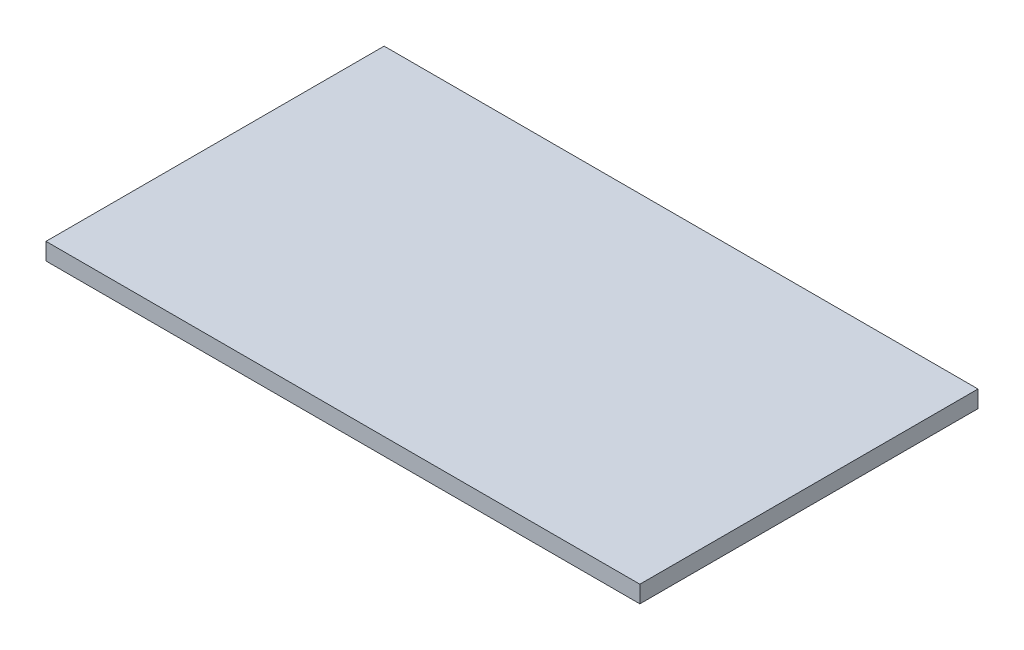
ISO-10303-21;
HEADER;
FILE_DESCRIPTION(('STEP AP214'),'2;1');
FILE_NAME('part.step','',(''),(''),'','','');
FILE_SCHEMA(('AUTOMOTIVE_DESIGN { 1 0 10303 214 1 1 1 1 }'));
ENDSEC;
DATA;
#1=APPLICATION_CONTEXT('core data for automotive mechanical design processes');
#2=APPLICATION_PROTOCOL_DEFINITION('international standard','automotive_design',2000,#1);
#3=PRODUCT_CONTEXT('',#1,'mechanical');
#4=PRODUCT('Part','Part','',(#3));
#5=PRODUCT_RELATED_PRODUCT_CATEGORY('part','',(#4));
#6=PRODUCT_DEFINITION_FORMATION('','',#4);
#7=PRODUCT_DEFINITION_CONTEXT('part definition',#1,'design');
#8=PRODUCT_DEFINITION('design','',#6,#7);
#9=PRODUCT_DEFINITION_SHAPE('','',#8);
#10=(LENGTH_UNIT() NAMED_UNIT(*) SI_UNIT(.MILLI.,.METRE.));
#11=(NAMED_UNIT(*) PLANE_ANGLE_UNIT() SI_UNIT($,.RADIAN.));
#12=(NAMED_UNIT(*) SI_UNIT($,.STERADIAN.) SOLID_ANGLE_UNIT());
#13=UNCERTAINTY_MEASURE_WITH_UNIT(LENGTH_MEASURE(1.E-05),#10,'distance_accuracy_value','');
#14=(GEOMETRIC_REPRESENTATION_CONTEXT(3) GLOBAL_UNCERTAINTY_ASSIGNED_CONTEXT((#13)) GLOBAL_UNIT_ASSIGNED_CONTEXT((#10,
#11,#12)) REPRESENTATION_CONTEXT('',''));
#15=CARTESIAN_POINT('',(0.,0.,0.));
#16=DIRECTION('',(0.,0.,1.));
#17=DIRECTION('',(1.,0.,0.));
#18=AXIS2_PLACEMENT_3D('',#15,#16,#17);
#19=CARTESIAN_POINT('',(-313.5,18.,178.5));
#20=DIRECTION('',(1.,0.,0.));
#21=DIRECTION('',(0.,0.,-1.));
#22=AXIS2_PLACEMENT_3D('',#19,#20,#21);
#23=PLANE('',#22);
#24=DIRECTION('',(0.,0.,1.));
#25=VECTOR('',#24,1.);
#26=CARTESIAN_POINT('',(-313.5,0.,178.5));
#27=LINE('',#26,#25);
#28=CARTESIAN_POINT('',(-313.5,0.,-178.5));
#29=VERTEX_POINT('',#28);
#30=CARTESIAN_POINT('',(-313.5,0.,178.5));
#31=VERTEX_POINT('',#30);
#32=EDGE_CURVE('E96',#29,#31,#27,.T.);
#33=ORIENTED_EDGE('',*,*,#32,.T.);
#34=DIRECTION('',(0.,-1.,0.));
#35=VECTOR('',#34,1.);
#36=CARTESIAN_POINT('',(-313.5,18.,178.5));
#37=LINE('',#36,#35);
#38=CARTESIAN_POINT('',(-313.5,18.,178.5));
#39=VERTEX_POINT('',#38);
#40=EDGE_CURVE('E11',#39,#31,#37,.T.);
#41=ORIENTED_EDGE('',*,*,#40,.F.);
#42=DIRECTION('',(0.,0.,1.));
#43=VECTOR('',#42,1.);
#44=CARTESIAN_POINT('',(-313.5,18.,178.5));
#45=LINE('',#44,#43);
#46=CARTESIAN_POINT('',(-313.5,18.,-178.5));
#47=VERTEX_POINT('',#46);
#48=EDGE_CURVE('E84',#47,#39,#45,.T.);
#49=ORIENTED_EDGE('',*,*,#48,.F.);
#50=DIRECTION('',(0.,-1.,0.));
#51=VECTOR('',#50,1.);
#52=CARTESIAN_POINT('',(-313.5,18.,-178.5));
#53=LINE('',#52,#51);
#54=EDGE_CURVE('E92',#47,#29,#53,.T.);
#55=ORIENTED_EDGE('',*,*,#54,.T.);
#56=EDGE_LOOP('',(#33,#41,#49,#55));
#57=FACE_BOUND('',#56,.T.);
#58=ADVANCED_FACE('F33',(#57),#23,.F.);
#59=CARTESIAN_POINT('',(313.5,18.,178.5));
#60=DIRECTION('',(0.,0.,-1.));
#61=DIRECTION('',(-1.,0.,0.));
#62=AXIS2_PLACEMENT_3D('',#59,#60,#61);
#63=PLANE('',#62);
#64=DIRECTION('',(1.,0.,0.));
#65=VECTOR('',#64,1.);
#66=CARTESIAN_POINT('',(313.5,0.,178.5));
#67=LINE('',#66,#65);
#68=CARTESIAN_POINT('',(313.5,0.,178.5));
#69=VERTEX_POINT('',#68);
#70=EDGE_CURVE('E88',#31,#69,#67,.T.);
#71=ORIENTED_EDGE('',*,*,#70,.T.);
#72=DIRECTION('',(0.,-1.,0.));
#73=VECTOR('',#72,1.);
#74=CARTESIAN_POINT('',(313.5,18.,178.5));
#75=LINE('',#74,#73);
#76=CARTESIAN_POINT('',(313.5,18.,178.5));
#77=VERTEX_POINT('',#76);
#78=EDGE_CURVE('E41',#77,#69,#75,.T.);
#79=ORIENTED_EDGE('',*,*,#78,.F.);
#80=DIRECTION('',(1.,0.,0.));
#81=VECTOR('',#80,1.);
#82=CARTESIAN_POINT('',(313.5,18.,178.5));
#83=LINE('',#82,#81);
#84=EDGE_CURVE('E79',#39,#77,#83,.T.);
#85=ORIENTED_EDGE('',*,*,#84,.F.);
#86=ORIENTED_EDGE('',*,*,#40,.T.);
#87=EDGE_LOOP('',(#71,#79,#85,#86));
#88=FACE_BOUND('',#87,.T.);
#89=ADVANCED_FACE('F87',(#88),#63,.F.);
#90=CARTESIAN_POINT('',(313.5,18.,178.5));
#91=DIRECTION('',(-1.,0.,0.));
#92=DIRECTION('',(0.,0.,1.));
#93=AXIS2_PLACEMENT_3D('',#90,#91,#92);
#94=PLANE('',#93);
#95=DIRECTION('',(0.,0.,-1.));
#96=VECTOR('',#95,1.);
#97=CARTESIAN_POINT('',(313.5,0.,178.5));
#98=LINE('',#97,#96);
#99=CARTESIAN_POINT('',(313.5,0.,-178.5));
#100=VERTEX_POINT('',#99);
#101=EDGE_CURVE('E66',#69,#100,#98,.T.);
#102=ORIENTED_EDGE('',*,*,#101,.T.);
#103=DIRECTION('',(0.,-1.,0.));
#104=VECTOR('',#103,1.);
#105=CARTESIAN_POINT('',(313.5,18.,-178.5));
#106=LINE('',#105,#104);
#107=CARTESIAN_POINT('',(313.5,18.,-178.5));
#108=VERTEX_POINT('',#107);
#109=EDGE_CURVE('E89',#108,#100,#106,.T.);
#110=ORIENTED_EDGE('',*,*,#109,.F.);
#111=DIRECTION('',(0.,0.,-1.));
#112=VECTOR('',#111,1.);
#113=CARTESIAN_POINT('',(313.5,18.,178.5));
#114=LINE('',#113,#112);
#115=EDGE_CURVE('E82',#77,#108,#114,.T.);
#116=ORIENTED_EDGE('',*,*,#115,.F.);
#117=ORIENTED_EDGE('',*,*,#78,.T.);
#118=EDGE_LOOP('',(#102,#110,#116,#117));
#119=FACE_BOUND('',#118,.T.);
#120=ADVANCED_FACE('F90',(#119),#94,.F.);
#121=CARTESIAN_POINT('',(313.5,18.,-178.5));
#122=DIRECTION('',(0.,0.,1.));
#123=DIRECTION('',(1.,0.,0.));
#124=AXIS2_PLACEMENT_3D('',#121,#122,#123);
#125=PLANE('',#124);
#126=DIRECTION('',(-1.,0.,0.));
#127=VECTOR('',#126,1.);
#128=CARTESIAN_POINT('',(313.5,0.,-178.5));
#129=LINE('',#128,#127);
#130=EDGE_CURVE('E72',#100,#29,#129,.T.);
#131=ORIENTED_EDGE('',*,*,#130,.T.);
#132=ORIENTED_EDGE('',*,*,#54,.F.);
#133=DIRECTION('',(-1.,0.,0.));
#134=VECTOR('',#133,1.);
#135=CARTESIAN_POINT('',(313.5,18.,-178.5));
#136=LINE('',#135,#134);
#137=EDGE_CURVE('E49',#108,#47,#136,.T.);
#138=ORIENTED_EDGE('',*,*,#137,.F.);
#139=ORIENTED_EDGE('',*,*,#109,.T.);
#140=EDGE_LOOP('',(#131,#132,#138,#139));
#141=FACE_BOUND('',#140,.T.);
#142=ADVANCED_FACE('F103',(#141),#125,.F.);
#143=CARTESIAN_POINT('',(0.,18.,0.));
#144=DIRECTION('',(0.,1.,0.));
#145=DIRECTION('',(0.,0.,1.));
#146=AXIS2_PLACEMENT_3D('',#143,#144,#145);
#147=PLANE('',#146);
#148=ORIENTED_EDGE('',*,*,#48,.T.);
#149=ORIENTED_EDGE('',*,*,#84,.T.);
#150=ORIENTED_EDGE('',*,*,#115,.T.);
#151=ORIENTED_EDGE('',*,*,#137,.T.);
#152=EDGE_LOOP('',(#148,#149,#150,#151));
#153=FACE_BOUND('',#152,.T.);
#154=ADVANCED_FACE('F80',(#153),#147,.T.);
#155=CARTESIAN_POINT('',(0.,0.,0.));
#156=DIRECTION('',(0.,1.,0.));
#157=DIRECTION('',(0.,0.,1.));
#158=AXIS2_PLACEMENT_3D('',#155,#156,#157);
#159=PLANE('',#158);
#160=ORIENTED_EDGE('',*,*,#32,.F.);
#161=ORIENTED_EDGE('',*,*,#130,.F.);
#162=ORIENTED_EDGE('',*,*,#101,.F.);
#163=ORIENTED_EDGE('',*,*,#70,.F.);
#164=EDGE_LOOP('',(#160,#161,#162,#163));
#165=FACE_BOUND('',#164,.T.);
#166=ADVANCED_FACE('F106',(#165),#159,.F.);
#167=CLOSED_SHELL('',(#58,#89,#120,#142,#154,#166));
#168=MANIFOLD_SOLID_BREP('B2',#167);
#169=ADVANCED_BREP_SHAPE_REPRESENTATION('',(#18,#168),#14);
#170=SHAPE_DEFINITION_REPRESENTATION(#9,#169);
ENDSEC;
END-ISO-10303-21;
